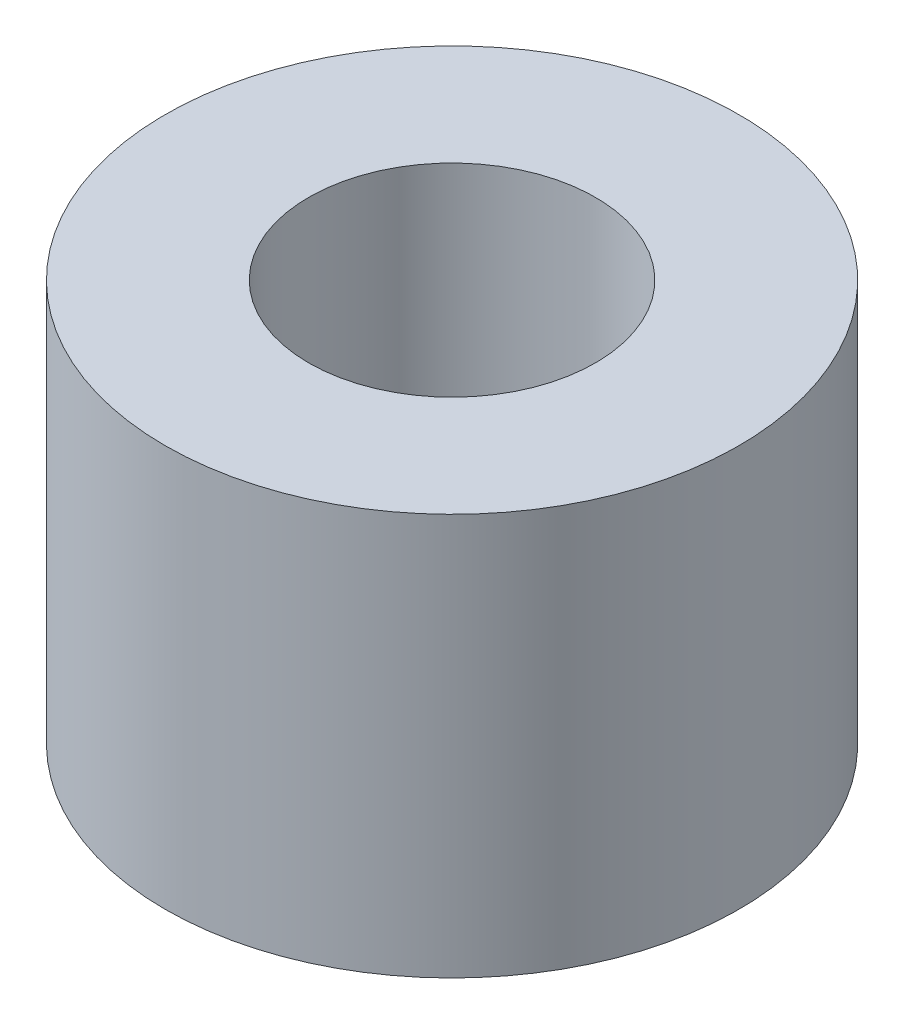
ISO-10303-21;
HEADER;
FILE_DESCRIPTION(('STEP AP214'),'2;1');
FILE_NAME('part.step','',(''),(''),'','','');
FILE_SCHEMA(('AUTOMOTIVE_DESIGN { 1 0 10303 214 1 1 1 1 }'));
ENDSEC;
DATA;
#1=APPLICATION_CONTEXT('core data for automotive mechanical design processes');
#2=APPLICATION_PROTOCOL_DEFINITION('international standard','automotive_design',2000,#1);
#3=PRODUCT_CONTEXT('',#1,'mechanical');
#4=PRODUCT('Part','Part','',(#3));
#5=PRODUCT_RELATED_PRODUCT_CATEGORY('part','',(#4));
#6=PRODUCT_DEFINITION_FORMATION('','',#4);
#7=PRODUCT_DEFINITION_CONTEXT('part definition',#1,'design');
#8=PRODUCT_DEFINITION('design','',#6,#7);
#9=PRODUCT_DEFINITION_SHAPE('','',#8);
#10=(LENGTH_UNIT() NAMED_UNIT(*) SI_UNIT(.MILLI.,.METRE.));
#11=(NAMED_UNIT(*) PLANE_ANGLE_UNIT() SI_UNIT($,.RADIAN.));
#12=(NAMED_UNIT(*) SI_UNIT($,.STERADIAN.) SOLID_ANGLE_UNIT());
#13=UNCERTAINTY_MEASURE_WITH_UNIT(LENGTH_MEASURE(1.E-05),#10,'distance_accuracy_value','');
#14=(GEOMETRIC_REPRESENTATION_CONTEXT(3) GLOBAL_UNCERTAINTY_ASSIGNED_CONTEXT((#13)) GLOBAL_UNIT_ASSIGNED_CONTEXT((#10,
#11,#12)) REPRESENTATION_CONTEXT('',''));
#15=CARTESIAN_POINT('',(0.,0.,0.));
#16=DIRECTION('',(0.,0.,1.));
#17=DIRECTION('',(1.,0.,0.));
#18=AXIS2_PLACEMENT_3D('',#15,#16,#17);
#19=CARTESIAN_POINT('',(0.,7.,0.));
#20=DIRECTION('',(0.,1.,0.));
#21=DIRECTION('',(0.,0.,1.));
#22=AXIS2_PLACEMENT_3D('',#19,#20,#21);
#23=PLANE('',#22);
#24=CARTESIAN_POINT('',(0.,7.,0.));
#25=DIRECTION('',(0.,1.,0.));
#26=DIRECTION('',(0.,0.,1.));
#27=AXIS2_PLACEMENT_3D('',#24,#25,#26);
#28=CIRCLE('',#27,5.);
#29=CARTESIAN_POINT('',(0.,7.,5.));
#30=VERTEX_POINT('',#29);
#31=EDGE_CURVE('E10',#30,#30,#28,.T.);
#32=ORIENTED_EDGE('',*,*,#31,.T.);
#33=EDGE_LOOP('',(#32));
#34=FACE_BOUND('',#33,.T.);
#35=CARTESIAN_POINT('',(0.,7.,0.));
#36=DIRECTION('',(0.,1.,0.));
#37=DIRECTION('',(0.,0.,1.));
#38=AXIS2_PLACEMENT_3D('',#35,#36,#37);
#39=CIRCLE('',#38,2.5);
#40=CARTESIAN_POINT('',(0.,7.,2.5));
#41=VERTEX_POINT('',#40);
#42=EDGE_CURVE('E43',#41,#41,#39,.T.);
#43=ORIENTED_EDGE('',*,*,#42,.F.);
#44=EDGE_LOOP('',(#43));
#45=FACE_BOUND('',#44,.T.);
#46=ADVANCED_FACE('F32',(#34,#45),#23,.T.);
#47=CARTESIAN_POINT('',(0.,0.,0.));
#48=DIRECTION('',(0.,1.,0.));
#49=DIRECTION('',(0.,0.,1.));
#50=AXIS2_PLACEMENT_3D('',#47,#48,#49);
#51=PLANE('',#50);
#52=CARTESIAN_POINT('',(0.,0.,0.));
#53=DIRECTION('',(0.,1.,0.));
#54=DIRECTION('',(0.,0.,1.));
#55=AXIS2_PLACEMENT_3D('',#52,#53,#54);
#56=CIRCLE('',#55,5.);
#57=CARTESIAN_POINT('',(0.,0.,5.));
#58=VERTEX_POINT('',#57);
#59=EDGE_CURVE('E36',#58,#58,#56,.T.);
#60=ORIENTED_EDGE('',*,*,#59,.F.);
#61=EDGE_LOOP('',(#60));
#62=FACE_BOUND('',#61,.T.);
#63=CARTESIAN_POINT('',(0.,0.,0.));
#64=DIRECTION('',(0.,1.,0.));
#65=DIRECTION('',(0.,0.,1.));
#66=AXIS2_PLACEMENT_3D('',#63,#64,#65);
#67=CIRCLE('',#66,2.5);
#68=CARTESIAN_POINT('',(0.,0.,2.5));
#69=VERTEX_POINT('',#68);
#70=EDGE_CURVE('E45',#69,#69,#67,.T.);
#71=ORIENTED_EDGE('',*,*,#70,.T.);
#72=EDGE_LOOP('',(#71));
#73=FACE_BOUND('',#72,.T.);
#74=ADVANCED_FACE('F55',(#62,#73),#51,.F.);
#75=CARTESIAN_POINT('',(0.,7.,0.));
#76=DIRECTION('',(0.,-1.,0.));
#77=DIRECTION('',(0.,0.,-1.));
#78=AXIS2_PLACEMENT_3D('',#75,#76,#77);
#79=CYLINDRICAL_SURFACE('',#78,5.);
#80=ORIENTED_EDGE('',*,*,#31,.F.);
#81=EDGE_LOOP('',(#80));
#82=FACE_BOUND('',#81,.T.);
#83=ORIENTED_EDGE('',*,*,#59,.T.);
#84=EDGE_LOOP('',(#83));
#85=FACE_BOUND('',#84,.T.);
#86=ADVANCED_FACE('F34',(#82,#85),#79,.T.);
#87=CARTESIAN_POINT('',(0.,7.,0.));
#88=DIRECTION('',(0.,-1.,0.));
#89=DIRECTION('',(0.,0.,-1.));
#90=AXIS2_PLACEMENT_3D('',#87,#88,#89);
#91=CYLINDRICAL_SURFACE('',#90,2.5);
#92=ORIENTED_EDGE('',*,*,#42,.T.);
#93=EDGE_LOOP('',(#92));
#94=FACE_BOUND('',#93,.T.);
#95=ORIENTED_EDGE('',*,*,#70,.F.);
#96=EDGE_LOOP('',(#95));
#97=FACE_BOUND('',#96,.T.);
#98=ADVANCED_FACE('F51',(#94,#97),#91,.F.);
#99=CLOSED_SHELL('',(#46,#74,#86,#98));
#100=MANIFOLD_SOLID_BREP('B2',#99);
#101=ADVANCED_BREP_SHAPE_REPRESENTATION('',(#18,#100),#14);
#102=SHAPE_DEFINITION_REPRESENTATION(#9,#101);
ENDSEC;
END-ISO-10303-21;
